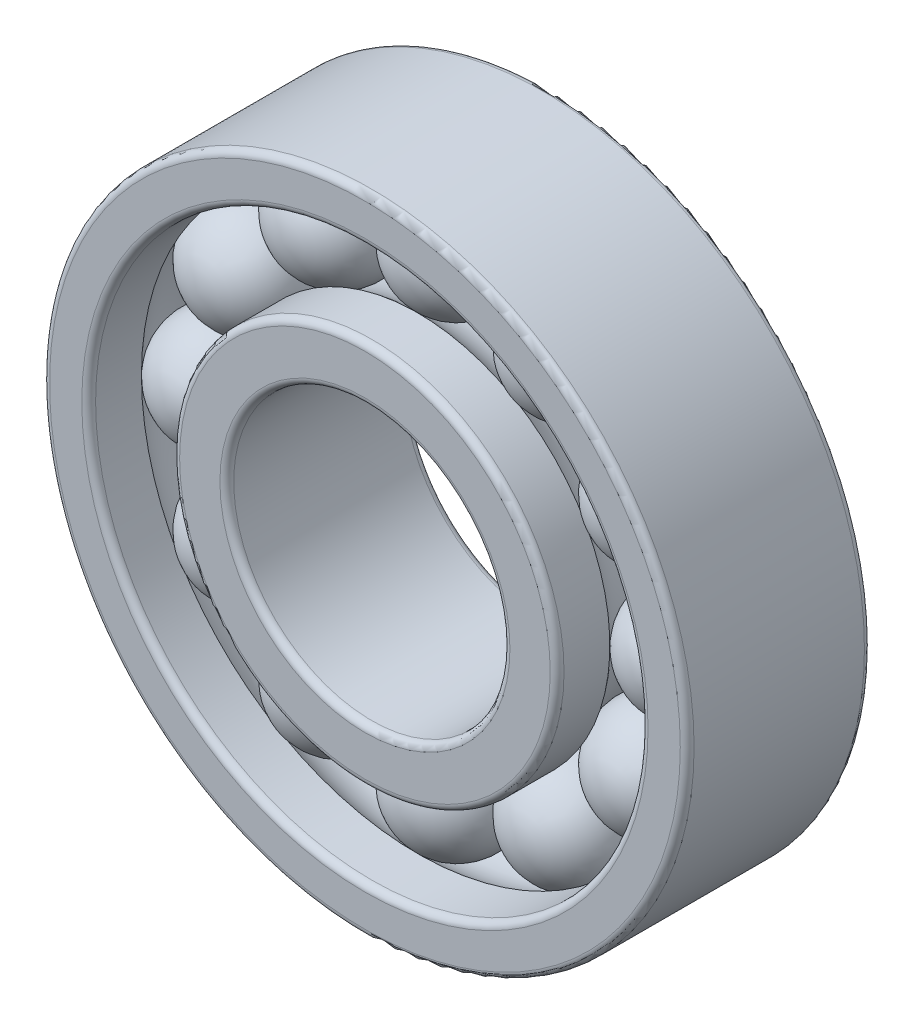
ISO-10303-21;
HEADER;
FILE_DESCRIPTION(('STEP AP214'),'2;1');
FILE_NAME('part.step','',(''),(''),'','','');
FILE_SCHEMA(('AUTOMOTIVE_DESIGN { 1 0 10303 214 1 1 1 1 }'));
ENDSEC;
DATA;
#1=APPLICATION_CONTEXT('core data for automotive mechanical design processes');
#2=APPLICATION_PROTOCOL_DEFINITION('international standard','automotive_design',2000,#1);
#3=PRODUCT_CONTEXT('',#1,'mechanical');
#4=PRODUCT('Part','Part','',(#3));
#5=PRODUCT_RELATED_PRODUCT_CATEGORY('part','',(#4));
#6=PRODUCT_DEFINITION_FORMATION('','',#4);
#7=PRODUCT_DEFINITION_CONTEXT('part definition',#1,'design');
#8=PRODUCT_DEFINITION('design','',#6,#7);
#9=PRODUCT_DEFINITION_SHAPE('','',#8);
#10=(LENGTH_UNIT() NAMED_UNIT(*) SI_UNIT(.MILLI.,.METRE.));
#11=(NAMED_UNIT(*) PLANE_ANGLE_UNIT() SI_UNIT($,.RADIAN.));
#12=(NAMED_UNIT(*) SI_UNIT($,.STERADIAN.) SOLID_ANGLE_UNIT());
#13=UNCERTAINTY_MEASURE_WITH_UNIT(LENGTH_MEASURE(1.E-05),#10,'distance_accuracy_value','');
#14=(GEOMETRIC_REPRESENTATION_CONTEXT(3) GLOBAL_UNCERTAINTY_ASSIGNED_CONTEXT((#13)) GLOBAL_UNIT_ASSIGNED_CONTEXT((#10,
#11,#12)) REPRESENTATION_CONTEXT('',''));
#15=CARTESIAN_POINT('',(0.,0.,0.));
#16=DIRECTION('',(0.,0.,1.));
#17=DIRECTION('',(1.,0.,0.));
#18=AXIS2_PLACEMENT_3D('',#15,#16,#17);
#19=CARTESIAN_POINT('',(-8.81180848350673,5.08749999999989,4.));
#20=DIRECTION('',(0.,0.,-1.));
#21=DIRECTION('',(0.866025403784445,-0.499999999999989,0.));
#22=AXIS2_PLACEMENT_3D('',#19,#20,#21);
#23=SPHERICAL_SURFACE('',#22,2.5);
#24=CARTESIAN_POINT('',(-8.81180848350673,5.08749999999989,1.5));
#25=VERTEX_POINT('',#24);
#26=VERTEX_LOOP('',#25);
#27=FACE_BOUND('',#26,.T.);
#28=ADVANCED_FACE('F76',(#27),#23,.T.);
#29=CLOSED_SHELL('',(#28));
#30=MANIFOLD_SOLID_BREP('B2',#29);
#31=CARTESIAN_POINT('',(-5.0875000000001,8.8118084835066,4.));
#32=DIRECTION('',(0.,0.,-1.));
#33=DIRECTION('',(0.50000000000001,-0.866025403784433,0.));
#34=AXIS2_PLACEMENT_3D('',#31,#32,#33);
#35=SPHERICAL_SURFACE('',#34,2.5);
#36=CARTESIAN_POINT('',(-5.0875000000001,8.8118084835066,1.5));
#37=VERTEX_POINT('',#36);
#38=VERTEX_LOOP('',#37);
#39=FACE_BOUND('',#38,.T.);
#40=ADVANCED_FACE('F95',(#39),#35,.T.);
#41=CLOSED_SHELL('',(#40));
#42=MANIFOLD_SOLID_BREP('B7',#41);
#43=CARTESIAN_POINT('',(-1.06577529597864E-13,10.175,4.));
#44=DIRECTION('',(0.,0.,-1.));
#45=DIRECTION('',(0.,-1.,0.));
#46=AXIS2_PLACEMENT_3D('',#43,#44,#45);
#47=SPHERICAL_SURFACE('',#46,2.5);
#48=CARTESIAN_POINT('',(-1.06577529597864E-13,10.175,1.5));
#49=VERTEX_POINT('',#48);
#50=VERTEX_LOOP('',#49);
#51=FACE_BOUND('',#50,.T.);
#52=ADVANCED_FACE('F113',(#51),#47,.T.);
#53=CLOSED_SHELL('',(#52));
#54=MANIFOLD_SOLID_BREP('B72',#53);
#55=CARTESIAN_POINT('',(5.08749999999992,8.81180848350671,4.));
#56=DIRECTION('',(0.,0.,-1.));
#57=DIRECTION('',(-0.499999999999992,-0.866025403784443,0.));
#58=AXIS2_PLACEMENT_3D('',#55,#56,#57);
#59=SPHERICAL_SURFACE('',#58,2.5);
#60=CARTESIAN_POINT('',(5.08749999999992,8.81180848350671,1.5));
#61=VERTEX_POINT('',#60);
#62=VERTEX_LOOP('',#61);
#63=FACE_BOUND('',#62,.T.);
#64=ADVANCED_FACE('F131',(#63),#59,.T.);
#65=CLOSED_SHELL('',(#64));
#66=MANIFOLD_SOLID_BREP('B91',#65);
#67=CARTESIAN_POINT('',(8.81180848350662,5.08750000000007,4.));
#68=DIRECTION('',(0.,0.,-1.));
#69=DIRECTION('',(-0.866025403784435,-0.500000000000007,0.));
#70=AXIS2_PLACEMENT_3D('',#67,#68,#69);
#71=SPHERICAL_SURFACE('',#70,2.5);
#72=CARTESIAN_POINT('',(8.81180848350662,5.08750000000007,1.5));
#73=VERTEX_POINT('',#72);
#74=VERTEX_LOOP('',#73);
#75=FACE_BOUND('',#74,.T.);
#76=ADVANCED_FACE('F150',(#75),#71,.T.);
#77=CLOSED_SHELL('',(#76));
#78=MANIFOLD_SOLID_BREP('B109',#77);
#79=CARTESIAN_POINT('',(10.175,0.,4.));
#80=DIRECTION('',(0.,0.,-1.));
#81=DIRECTION('',(-1.,0.,0.));
#82=AXIS2_PLACEMENT_3D('',#79,#80,#81);
#83=SPHERICAL_SURFACE('',#82,2.5);
#84=CARTESIAN_POINT('',(10.175,0.,1.5));
#85=VERTEX_POINT('',#84);
#86=VERTEX_LOOP('',#85);
#87=FACE_BOUND('',#86,.T.);
#88=ADVANCED_FACE('F169',(#87),#83,.T.);
#89=CLOSED_SHELL('',(#88));
#90=MANIFOLD_SOLID_BREP('B127',#89);
#91=CARTESIAN_POINT('',(8.81180848350669,-5.08749999999995,4.));
#92=DIRECTION('',(0.,0.,-1.));
#93=DIRECTION('',(-0.866025403784442,0.499999999999995,0.));
#94=AXIS2_PLACEMENT_3D('',#91,#92,#93);
#95=SPHERICAL_SURFACE('',#94,2.5);
#96=CARTESIAN_POINT('',(8.81180848350669,-5.08749999999995,1.5));
#97=VERTEX_POINT('',#96);
#98=VERTEX_LOOP('',#97);
#99=FACE_BOUND('',#98,.T.);
#100=ADVANCED_FACE('F188',(#99),#95,.T.);
#101=CLOSED_SHELL('',(#100));
#102=MANIFOLD_SOLID_BREP('B146',#101);
#103=CARTESIAN_POINT('',(5.08750000000004,-8.81180848350664,4.));
#104=DIRECTION('',(0.,0.,-1.));
#105=DIRECTION('',(-0.500000000000004,0.866025403784436,0.));
#106=AXIS2_PLACEMENT_3D('',#103,#104,#105);
#107=SPHERICAL_SURFACE('',#106,2.5);
#108=CARTESIAN_POINT('',(5.08750000000004,-8.81180848350664,1.5));
#109=VERTEX_POINT('',#108);
#110=VERTEX_LOOP('',#109);
#111=FACE_BOUND('',#110,.T.);
#112=ADVANCED_FACE('F207',(#111),#107,.T.);
#113=CLOSED_SHELL('',(#112));
#114=MANIFOLD_SOLID_BREP('B165',#113);
#115=CARTESIAN_POINT('',(0.,-10.175,4.));
#116=DIRECTION('',(0.,0.,-1.));
#117=DIRECTION('',(0.,1.,0.));
#118=AXIS2_PLACEMENT_3D('',#115,#116,#117);
#119=SPHERICAL_SURFACE('',#118,2.5);
#120=CARTESIAN_POINT('',(0.,-10.175,1.5));
#121=VERTEX_POINT('',#120);
#122=VERTEX_LOOP('',#121);
#123=FACE_BOUND('',#122,.T.);
#124=ADVANCED_FACE('F226',(#123),#119,.T.);
#125=CLOSED_SHELL('',(#124));
#126=MANIFOLD_SOLID_BREP('B184',#125);
#127=CARTESIAN_POINT('',(-5.08749999999998,-8.81180848350667,4.));
#128=DIRECTION('',(0.,0.,-1.));
#129=DIRECTION('',(0.499999999999998,0.86602540378444,0.));
#130=AXIS2_PLACEMENT_3D('',#127,#128,#129);
#131=SPHERICAL_SURFACE('',#130,2.5);
#132=CARTESIAN_POINT('',(-5.08749999999998,-8.81180848350667,1.5));
#133=VERTEX_POINT('',#132);
#134=VERTEX_LOOP('',#133);
#135=FACE_BOUND('',#134,.T.);
#136=ADVANCED_FACE('F245',(#135),#131,.T.);
#137=CLOSED_SHELL('',(#136));
#138=MANIFOLD_SOLID_BREP('B203',#137);
#139=CARTESIAN_POINT('',(-8.81180848350666,-5.08750000000001,4.));
#140=DIRECTION('',(0.,0.,-1.));
#141=DIRECTION('',(0.866025403784438,0.500000000000001,0.));
#142=AXIS2_PLACEMENT_3D('',#139,#140,#141);
#143=SPHERICAL_SURFACE('',#142,2.5);
#144=CARTESIAN_POINT('',(-8.81180848350666,-5.08750000000001,1.5));
#145=VERTEX_POINT('',#144);
#146=VERTEX_LOOP('',#145);
#147=FACE_BOUND('',#146,.T.);
#148=ADVANCED_FACE('F264',(#147),#143,.T.);
#149=CLOSED_SHELL('',(#148));
#150=MANIFOLD_SOLID_BREP('B222',#149);
#151=CARTESIAN_POINT('',(-10.175,0.,4.));
#152=DIRECTION('',(0.,0.,-1.));
#153=DIRECTION('',(1.,0.,0.));
#154=AXIS2_PLACEMENT_3D('',#151,#152,#153);
#155=SPHERICAL_SURFACE('',#154,2.5);
#156=CARTESIAN_POINT('',(-10.175,0.,1.5));
#157=VERTEX_POINT('',#156);
#158=VERTEX_LOOP('',#157);
#159=FACE_BOUND('',#158,.T.);
#160=ADVANCED_FACE('F285',(#159),#155,.T.);
#161=CLOSED_SHELL('',(#160));
#162=MANIFOLD_SOLID_BREP('B241',#161);
#163=CARTESIAN_POINT('',(0.,0.,8.));
#164=DIRECTION('',(0.,0.,-1.));
#165=DIRECTION('',(-1.,0.,0.));
#166=AXIS2_PLACEMENT_3D('',#163,#164,#165);
#167=CYLINDRICAL_SURFACE('',#166,8.35);
#168=CARTESIAN_POINT('',(0.,0.,0.3));
#169=DIRECTION('',(0.,0.,1.));
#170=DIRECTION('',(1.,0.,0.));
#171=AXIS2_PLACEMENT_3D('',#168,#169,#170);
#172=CIRCLE('',#171,8.35);
#173=CARTESIAN_POINT('',(8.35,0.,0.3));
#174=VERTEX_POINT('',#173);
#175=EDGE_CURVE('E284',#174,#174,#172,.T.);
#176=ORIENTED_EDGE('',*,*,#175,.T.);
#177=EDGE_LOOP('',(#176));
#178=FACE_BOUND('',#177,.T.);
#179=CARTESIAN_POINT('',(0.,0.,2.29138213751582));
#180=DIRECTION('',(0.,0.,1.));
#181=DIRECTION('',(1.,0.,0.));
#182=AXIS2_PLACEMENT_3D('',#179,#180,#181);
#183=CIRCLE('',#182,8.35);
#184=CARTESIAN_POINT('',(8.35,0.,2.29138213751582));
#185=VERTEX_POINT('',#184);
#186=EDGE_CURVE('E337',#185,#185,#183,.F.);
#187=ORIENTED_EDGE('',*,*,#186,.T.);
#188=EDGE_LOOP('',(#187));
#189=FACE_BOUND('',#188,.T.);
#190=ADVANCED_FACE('F305',(#178,#189),#167,.T.);
#191=CARTESIAN_POINT('',(0.,0.,8.));
#192=DIRECTION('',(0.,0.,1.));
#193=DIRECTION('',(1.,0.,0.));
#194=AXIS2_PLACEMENT_3D('',#191,#192,#193);
#195=PLANE('',#194);
#196=CARTESIAN_POINT('',(0.,0.,8.));
#197=DIRECTION('',(0.,0.,1.));
#198=DIRECTION('',(1.,0.,0.));
#199=AXIS2_PLACEMENT_3D('',#196,#197,#198);
#200=CIRCLE('',#199,6.3);
#201=CARTESIAN_POINT('',(6.3,0.,8.));
#202=VERTEX_POINT('',#201);
#203=EDGE_CURVE('E325',#202,#202,#200,.F.);
#204=ORIENTED_EDGE('',*,*,#203,.T.);
#205=EDGE_LOOP('',(#204));
#206=FACE_BOUND('',#205,.T.);
#207=CARTESIAN_POINT('',(0.,0.,8.));
#208=DIRECTION('',(0.,0.,1.));
#209=DIRECTION('',(1.,0.,0.));
#210=AXIS2_PLACEMENT_3D('',#207,#208,#209);
#211=CIRCLE('',#210,8.05);
#212=CARTESIAN_POINT('',(8.05,0.,8.));
#213=VERTEX_POINT('',#212);
#214=EDGE_CURVE('E328',#213,#213,#211,.T.);
#215=ORIENTED_EDGE('',*,*,#214,.T.);
#216=EDGE_LOOP('',(#215));
#217=FACE_BOUND('',#216,.T.);
#218=ADVANCED_FACE('F364',(#206,#217),#195,.T.);
#219=CARTESIAN_POINT('',(0.,0.,0.));
#220=DIRECTION('',(0.,0.,1.));
#221=DIRECTION('',(1.,0.,0.));
#222=AXIS2_PLACEMENT_3D('',#219,#220,#221);
#223=PLANE('',#222);
#224=CARTESIAN_POINT('',(0.,0.,0.));
#225=DIRECTION('',(0.,0.,1.));
#226=DIRECTION('',(1.,0.,0.));
#227=AXIS2_PLACEMENT_3D('',#224,#225,#226);
#228=CIRCLE('',#227,6.3);
#229=CARTESIAN_POINT('',(6.3,0.,0.));
#230=VERTEX_POINT('',#229);
#231=EDGE_CURVE('E312',#230,#230,#228,.T.);
#232=ORIENTED_EDGE('',*,*,#231,.T.);
#233=EDGE_LOOP('',(#232));
#234=FACE_BOUND('',#233,.T.);
#235=CARTESIAN_POINT('',(0.,0.,0.));
#236=DIRECTION('',(0.,0.,1.));
#237=DIRECTION('',(1.,0.,0.));
#238=AXIS2_PLACEMENT_3D('',#235,#236,#237);
#239=CIRCLE('',#238,8.05);
#240=CARTESIAN_POINT('',(8.05,0.,0.));
#241=VERTEX_POINT('',#240);
#242=EDGE_CURVE('E316',#241,#241,#239,.F.);
#243=ORIENTED_EDGE('',*,*,#242,.T.);
#244=EDGE_LOOP('',(#243));
#245=FACE_BOUND('',#244,.T.);
#246=ADVANCED_FACE('F368',(#234,#245),#223,.F.);
#247=CARTESIAN_POINT('',(0.,0.,7.7));
#248=DIRECTION('',(0.,0.,1.));
#249=DIRECTION('',(1.,0.,0.));
#250=AXIS2_PLACEMENT_3D('',#247,#248,#249);
#251=CIRCLE('',#250,8.35);
#252=CARTESIAN_POINT('',(8.35,0.,7.7));
#253=VERTEX_POINT('',#252);
#254=EDGE_CURVE('E320',#253,#253,#251,.F.);
#255=ORIENTED_EDGE('',*,*,#254,.T.);
#256=EDGE_LOOP('',(#255));
#257=FACE_BOUND('',#256,.T.);
#258=CARTESIAN_POINT('',(0.,0.,5.70861786248418));
#259=DIRECTION('',(0.,0.,-1.));
#260=DIRECTION('',(-1.,0.,0.));
#261=AXIS2_PLACEMENT_3D('',#258,#259,#260);
#262=CIRCLE('',#261,8.35);
#263=CARTESIAN_POINT('',(-8.35,0.,5.70861786248418));
#264=VERTEX_POINT('',#263);
#265=EDGE_CURVE('E340',#264,#264,#262,.F.);
#266=ORIENTED_EDGE('',*,*,#265,.T.);
#267=EDGE_LOOP('',(#266));
#268=FACE_BOUND('',#267,.T.);
#269=ADVANCED_FACE('F344',(#257,#268),#167,.T.);
#270=CARTESIAN_POINT('',(0.,0.,8.));
#271=DIRECTION('',(0.,0.,-1.));
#272=DIRECTION('',(-1.,0.,0.));
#273=AXIS2_PLACEMENT_3D('',#270,#271,#272);
#274=CYLINDRICAL_SURFACE('',#273,6.);
#275=CARTESIAN_POINT('',(0.,0.,7.7));
#276=DIRECTION('',(0.,0.,1.));
#277=DIRECTION('',(1.,0.,0.));
#278=AXIS2_PLACEMENT_3D('',#275,#276,#277);
#279=CIRCLE('',#278,6.);
#280=CARTESIAN_POINT('',(6.,0.,7.7));
#281=VERTEX_POINT('',#280);
#282=EDGE_CURVE('E331',#281,#281,#279,.T.);
#283=ORIENTED_EDGE('',*,*,#282,.T.);
#284=EDGE_LOOP('',(#283));
#285=FACE_BOUND('',#284,.T.);
#286=CARTESIAN_POINT('',(0.,0.,0.3));
#287=DIRECTION('',(0.,0.,1.));
#288=DIRECTION('',(1.,0.,0.));
#289=AXIS2_PLACEMENT_3D('',#286,#287,#288);
#290=CIRCLE('',#289,6.);
#291=CARTESIAN_POINT('',(6.,0.,0.3));
#292=VERTEX_POINT('',#291);
#293=EDGE_CURVE('E334',#292,#292,#290,.F.);
#294=ORIENTED_EDGE('',*,*,#293,.T.);
#295=EDGE_LOOP('',(#294));
#296=FACE_BOUND('',#295,.T.);
#297=ADVANCED_FACE('F349',(#285,#296),#274,.F.);
#298=CARTESIAN_POINT('',(0.,0.,4.));
#299=DIRECTION('',(0.,0.,-1.));
#300=DIRECTION('',(-1.,0.,0.));
#301=AXIS2_PLACEMENT_3D('',#298,#299,#300);
#302=TOROIDAL_SURFACE('',#301,10.175,2.5);
#303=ORIENTED_EDGE('',*,*,#186,.F.);
#304=EDGE_LOOP('',(#303));
#305=FACE_BOUND('',#304,.T.);
#306=ORIENTED_EDGE('',*,*,#265,.F.);
#307=EDGE_LOOP('',(#306));
#308=FACE_BOUND('',#307,.T.);
#309=ADVANCED_FACE('F346',(#305,#308),#302,.F.);
#310=CARTESIAN_POINT('',(0.,0.,7.7));
#311=DIRECTION('',(0.,0.,1.));
#312=DIRECTION('',(1.,0.,0.));
#313=AXIS2_PLACEMENT_3D('',#310,#311,#312);
#314=TOROIDAL_SURFACE('',#313,6.3,0.3);
#315=ORIENTED_EDGE('',*,*,#203,.F.);
#316=EDGE_LOOP('',(#315));
#317=FACE_BOUND('',#316,.T.);
#318=ORIENTED_EDGE('',*,*,#282,.F.);
#319=EDGE_LOOP('',(#318));
#320=FACE_BOUND('',#319,.T.);
#321=ADVANCED_FACE('F348',(#317,#320),#314,.T.);
#322=CARTESIAN_POINT('',(0.,0.,7.7));
#323=DIRECTION('',(0.,0.,1.));
#324=DIRECTION('',(1.,0.,0.));
#325=AXIS2_PLACEMENT_3D('',#322,#323,#324);
#326=TOROIDAL_SURFACE('',#325,8.05,0.3);
#327=ORIENTED_EDGE('',*,*,#254,.F.);
#328=EDGE_LOOP('',(#327));
#329=FACE_BOUND('',#328,.T.);
#330=ORIENTED_EDGE('',*,*,#214,.F.);
#331=EDGE_LOOP('',(#330));
#332=FACE_BOUND('',#331,.T.);
#333=ADVANCED_FACE('F356',(#329,#332),#326,.T.);
#334=CARTESIAN_POINT('',(0.,0.,0.3));
#335=DIRECTION('',(0.,0.,1.));
#336=DIRECTION('',(1.,0.,0.));
#337=AXIS2_PLACEMENT_3D('',#334,#335,#336);
#338=TOROIDAL_SURFACE('',#337,6.3,0.3);
#339=ORIENTED_EDGE('',*,*,#293,.F.);
#340=EDGE_LOOP('',(#339));
#341=FACE_BOUND('',#340,.T.);
#342=ORIENTED_EDGE('',*,*,#231,.F.);
#343=EDGE_LOOP('',(#342));
#344=FACE_BOUND('',#343,.T.);
#345=ADVANCED_FACE('F382',(#341,#344),#338,.T.);
#346=CARTESIAN_POINT('',(0.,0.,0.3));
#347=DIRECTION('',(0.,0.,1.));
#348=DIRECTION('',(1.,0.,0.));
#349=AXIS2_PLACEMENT_3D('',#346,#347,#348);
#350=TOROIDAL_SURFACE('',#349,8.05,0.3);
#351=ORIENTED_EDGE('',*,*,#242,.F.);
#352=EDGE_LOOP('',(#351));
#353=FACE_BOUND('',#352,.T.);
#354=ORIENTED_EDGE('',*,*,#175,.F.);
#355=EDGE_LOOP('',(#354));
#356=FACE_BOUND('',#355,.T.);
#357=ADVANCED_FACE('F307',(#353,#356),#350,.T.);
#358=CLOSED_SHELL('',(#190,#218,#246,#269,#297,#309,#321,#333,#345,#357));
#359=MANIFOLD_SOLID_BREP('B260',#358);
#360=CARTESIAN_POINT('',(0.,0.,8.));
#361=DIRECTION('',(0.,0.,-1.));
#362=DIRECTION('',(-1.,0.,0.));
#363=AXIS2_PLACEMENT_3D('',#360,#361,#362);
#364=CYLINDRICAL_SURFACE('',#363,12.);
#365=CARTESIAN_POINT('',(0.,0.,0.3));
#366=DIRECTION('',(0.,0.,1.));
#367=DIRECTION('',(1.,0.,0.));
#368=AXIS2_PLACEMENT_3D('',#365,#366,#367);
#369=CIRCLE('',#368,12.);
#370=CARTESIAN_POINT('',(12.,0.,0.3));
#371=VERTEX_POINT('',#370);
#372=EDGE_CURVE('E479',#371,#371,#369,.F.);
#373=ORIENTED_EDGE('',*,*,#372,.T.);
#374=EDGE_LOOP('',(#373));
#375=FACE_BOUND('',#374,.T.);
#376=CARTESIAN_POINT('',(0.,0.,2.29138213751582));
#377=DIRECTION('',(0.,0.,1.));
#378=DIRECTION('',(1.,0.,0.));
#379=AXIS2_PLACEMENT_3D('',#376,#377,#378);
#380=CIRCLE('',#379,12.);
#381=CARTESIAN_POINT('',(12.,0.,2.29138213751582));
#382=VERTEX_POINT('',#381);
#383=EDGE_CURVE('E488',#382,#382,#380,.F.);
#384=ORIENTED_EDGE('',*,*,#383,.F.);
#385=EDGE_LOOP('',(#384));
#386=FACE_BOUND('',#385,.T.);
#387=ADVANCED_FACE('F456',(#375,#386),#364,.F.);
#388=CARTESIAN_POINT('',(0.,0.,8.));
#389=DIRECTION('',(0.,0.,1.));
#390=DIRECTION('',(1.,0.,0.));
#391=AXIS2_PLACEMENT_3D('',#388,#389,#390);
#392=PLANE('',#391);
#393=CARTESIAN_POINT('',(0.,0.,8.));
#394=DIRECTION('',(0.,0.,1.));
#395=DIRECTION('',(1.,0.,0.));
#396=AXIS2_PLACEMENT_3D('',#393,#394,#395);
#397=CIRCLE('',#396,12.3);
#398=CARTESIAN_POINT('',(12.3,0.,8.));
#399=VERTEX_POINT('',#398);
#400=EDGE_CURVE('E304',#399,#399,#397,.F.);
#401=ORIENTED_EDGE('',*,*,#400,.T.);
#402=EDGE_LOOP('',(#401));
#403=FACE_BOUND('',#402,.T.);
#404=CARTESIAN_POINT('',(0.,0.,8.));
#405=DIRECTION('',(0.,0.,1.));
#406=DIRECTION('',(1.,0.,0.));
#407=AXIS2_PLACEMENT_3D('',#404,#405,#406);
#408=CIRCLE('',#407,13.7);
#409=CARTESIAN_POINT('',(13.7,0.,8.));
#410=VERTEX_POINT('',#409);
#411=EDGE_CURVE('E463',#410,#410,#408,.T.);
#412=ORIENTED_EDGE('',*,*,#411,.T.);
#413=EDGE_LOOP('',(#412));
#414=FACE_BOUND('',#413,.T.);
#415=ADVANCED_FACE('F514',(#403,#414),#392,.T.);
#416=CARTESIAN_POINT('',(0.,0.,0.));
#417=DIRECTION('',(0.,0.,1.));
#418=DIRECTION('',(1.,0.,0.));
#419=AXIS2_PLACEMENT_3D('',#416,#417,#418);
#420=PLANE('',#419);
#421=CARTESIAN_POINT('',(0.,0.,0.));
#422=DIRECTION('',(0.,0.,1.));
#423=DIRECTION('',(1.,0.,0.));
#424=AXIS2_PLACEMENT_3D('',#421,#422,#423);
#425=CIRCLE('',#424,12.3);
#426=CARTESIAN_POINT('',(12.3,0.,0.));
#427=VERTEX_POINT('',#426);
#428=EDGE_CURVE('E482',#427,#427,#425,.T.);
#429=ORIENTED_EDGE('',*,*,#428,.T.);
#430=EDGE_LOOP('',(#429));
#431=FACE_BOUND('',#430,.T.);
#432=CARTESIAN_POINT('',(0.,0.,0.));
#433=DIRECTION('',(0.,0.,1.));
#434=DIRECTION('',(1.,0.,0.));
#435=AXIS2_PLACEMENT_3D('',#432,#433,#434);
#436=CIRCLE('',#435,13.7);
#437=CARTESIAN_POINT('',(13.7,0.,0.));
#438=VERTEX_POINT('',#437);
#439=EDGE_CURVE('E485',#438,#438,#436,.F.);
#440=ORIENTED_EDGE('',*,*,#439,.T.);
#441=EDGE_LOOP('',(#440));
#442=FACE_BOUND('',#441,.T.);
#443=ADVANCED_FACE('F509',(#431,#442),#420,.F.);
#444=CARTESIAN_POINT('',(0.,0.,8.));
#445=DIRECTION('',(0.,0.,-1.));
#446=DIRECTION('',(-1.,0.,0.));
#447=AXIS2_PLACEMENT_3D('',#444,#445,#446);
#448=CYLINDRICAL_SURFACE('',#447,14.);
#449=CARTESIAN_POINT('',(0.,0.,0.3));
#450=DIRECTION('',(0.,0.,1.));
#451=DIRECTION('',(1.,0.,0.));
#452=AXIS2_PLACEMENT_3D('',#449,#450,#451);
#453=CIRCLE('',#452,14.);
#454=CARTESIAN_POINT('',(14.,0.,0.3));
#455=VERTEX_POINT('',#454);
#456=EDGE_CURVE('E471',#455,#455,#453,.T.);
#457=ORIENTED_EDGE('',*,*,#456,.T.);
#458=EDGE_LOOP('',(#457));
#459=FACE_BOUND('',#458,.T.);
#460=CARTESIAN_POINT('',(0.,0.,7.7));
#461=DIRECTION('',(0.,0.,1.));
#462=DIRECTION('',(1.,0.,0.));
#463=AXIS2_PLACEMENT_3D('',#460,#461,#462);
#464=CIRCLE('',#463,14.);
#465=CARTESIAN_POINT('',(14.,0.,7.7));
#466=VERTEX_POINT('',#465);
#467=EDGE_CURVE('E476',#466,#466,#464,.F.);
#468=ORIENTED_EDGE('',*,*,#467,.T.);
#469=EDGE_LOOP('',(#468));
#470=FACE_BOUND('',#469,.T.);
#471=ADVANCED_FACE('F500',(#459,#470),#448,.T.);
#472=CARTESIAN_POINT('',(0.,0.,7.7));
#473=DIRECTION('',(0.,0.,1.));
#474=DIRECTION('',(1.,0.,0.));
#475=AXIS2_PLACEMENT_3D('',#472,#473,#474);
#476=CIRCLE('',#475,12.);
#477=CARTESIAN_POINT('',(12.,0.,7.7));
#478=VERTEX_POINT('',#477);
#479=EDGE_CURVE('E467',#478,#478,#476,.T.);
#480=ORIENTED_EDGE('',*,*,#479,.T.);
#481=EDGE_LOOP('',(#480));
#482=FACE_BOUND('',#481,.T.);
#483=CARTESIAN_POINT('',(0.,0.,5.70861786248418));
#484=DIRECTION('',(0.,0.,-1.));
#485=DIRECTION('',(-1.,0.,0.));
#486=AXIS2_PLACEMENT_3D('',#483,#484,#485);
#487=CIRCLE('',#486,12.);
#488=CARTESIAN_POINT('',(-12.,0.,5.70861786248418));
#489=VERTEX_POINT('',#488);
#490=EDGE_CURVE('E491',#489,#489,#487,.F.);
#491=ORIENTED_EDGE('',*,*,#490,.F.);
#492=EDGE_LOOP('',(#491));
#493=FACE_BOUND('',#492,.T.);
#494=ADVANCED_FACE('F498',(#482,#493),#364,.F.);
#495=CARTESIAN_POINT('',(0.,0.,4.));
#496=DIRECTION('',(0.,0.,-1.));
#497=DIRECTION('',(-1.,0.,0.));
#498=AXIS2_PLACEMENT_3D('',#495,#496,#497);
#499=TOROIDAL_SURFACE('',#498,10.175,2.5);
#500=ORIENTED_EDGE('',*,*,#490,.T.);
#501=EDGE_LOOP('',(#500));
#502=FACE_BOUND('',#501,.T.);
#503=ORIENTED_EDGE('',*,*,#383,.T.);
#504=EDGE_LOOP('',(#503));
#505=FACE_BOUND('',#504,.T.);
#506=ADVANCED_FACE('F495',(#502,#505),#499,.F.);
#507=CARTESIAN_POINT('',(0.,0.,0.3));
#508=DIRECTION('',(0.,0.,1.));
#509=DIRECTION('',(1.,0.,0.));
#510=AXIS2_PLACEMENT_3D('',#507,#508,#509);
#511=TOROIDAL_SURFACE('',#510,12.3,0.3);
#512=ORIENTED_EDGE('',*,*,#372,.F.);
#513=EDGE_LOOP('',(#512));
#514=FACE_BOUND('',#513,.T.);
#515=ORIENTED_EDGE('',*,*,#428,.F.);
#516=EDGE_LOOP('',(#515));
#517=FACE_BOUND('',#516,.T.);
#518=ADVANCED_FACE('F507',(#514,#517),#511,.T.);
#519=CARTESIAN_POINT('',(0.,0.,0.3));
#520=DIRECTION('',(0.,0.,1.));
#521=DIRECTION('',(1.,0.,0.));
#522=AXIS2_PLACEMENT_3D('',#519,#520,#521);
#523=TOROIDAL_SURFACE('',#522,13.7,0.3);
#524=ORIENTED_EDGE('',*,*,#439,.F.);
#525=EDGE_LOOP('',(#524));
#526=FACE_BOUND('',#525,.T.);
#527=ORIENTED_EDGE('',*,*,#456,.F.);
#528=EDGE_LOOP('',(#527));
#529=FACE_BOUND('',#528,.T.);
#530=ADVANCED_FACE('F525',(#526,#529),#523,.T.);
#531=CARTESIAN_POINT('',(0.,0.,7.7));
#532=DIRECTION('',(0.,0.,1.));
#533=DIRECTION('',(1.,0.,0.));
#534=AXIS2_PLACEMENT_3D('',#531,#532,#533);
#535=TOROIDAL_SURFACE('',#534,12.3,0.3);
#536=ORIENTED_EDGE('',*,*,#400,.F.);
#537=EDGE_LOOP('',(#536));
#538=FACE_BOUND('',#537,.T.);
#539=ORIENTED_EDGE('',*,*,#479,.F.);
#540=EDGE_LOOP('',(#539));
#541=FACE_BOUND('',#540,.T.);
#542=ADVANCED_FACE('F536',(#538,#541),#535,.T.);
#543=CARTESIAN_POINT('',(0.,0.,7.7));
#544=DIRECTION('',(0.,0.,1.));
#545=DIRECTION('',(1.,0.,0.));
#546=AXIS2_PLACEMENT_3D('',#543,#544,#545);
#547=TOROIDAL_SURFACE('',#546,13.7,0.3);
#548=ORIENTED_EDGE('',*,*,#467,.F.);
#549=EDGE_LOOP('',(#548));
#550=FACE_BOUND('',#549,.T.);
#551=ORIENTED_EDGE('',*,*,#411,.F.);
#552=EDGE_LOOP('',(#551));
#553=FACE_BOUND('',#552,.T.);
#554=ADVANCED_FACE('F458',(#550,#553),#547,.T.);
#555=CLOSED_SHELL('',(#387,#415,#443,#471,#494,#506,#518,#530,#542,#554));
#556=MANIFOLD_SOLID_BREP('B279',#555);
#557=ADVANCED_BREP_SHAPE_REPRESENTATION('',(#18,#30,#42,#54,#66,#78,#90,#102,#114,#126,#138,
#150,#162,#359,#556),#14);
#558=SHAPE_DEFINITION_REPRESENTATION(#9,#557);
ENDSEC;
END-ISO-10303-21;
